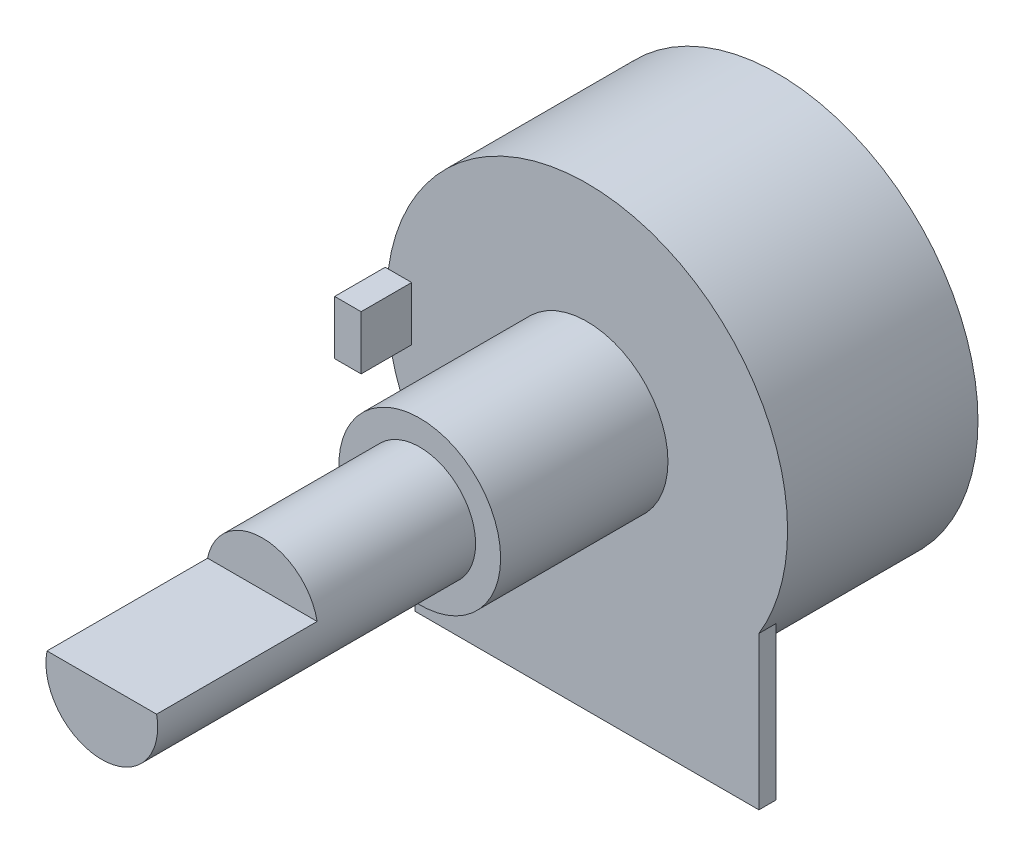
ISO-10303-21;
HEADER;
FILE_DESCRIPTION(('STEP AP214'),'2;1');
FILE_NAME('part.step','',(''),(''),'','','');
FILE_SCHEMA(('AUTOMOTIVE_DESIGN { 1 0 10303 214 1 1 1 1 }'));
ENDSEC;
DATA;
#1=APPLICATION_CONTEXT('core data for automotive mechanical design processes');
#2=APPLICATION_PROTOCOL_DEFINITION('international standard','automotive_design',2000,#1);
#3=PRODUCT_CONTEXT('',#1,'mechanical');
#4=PRODUCT('Part','Part','',(#3));
#5=PRODUCT_RELATED_PRODUCT_CATEGORY('part','',(#4));
#6=PRODUCT_DEFINITION_FORMATION('','',#4);
#7=PRODUCT_DEFINITION_CONTEXT('part definition',#1,'design');
#8=PRODUCT_DEFINITION('design','',#6,#7);
#9=PRODUCT_DEFINITION_SHAPE('','',#8);
#10=(LENGTH_UNIT() NAMED_UNIT(*) SI_UNIT(.MILLI.,.METRE.));
#11=(NAMED_UNIT(*) PLANE_ANGLE_UNIT() SI_UNIT($,.RADIAN.));
#12=(NAMED_UNIT(*) SI_UNIT($,.STERADIAN.) SOLID_ANGLE_UNIT());
#13=UNCERTAINTY_MEASURE_WITH_UNIT(LENGTH_MEASURE(1.E-05),#10,'distance_accuracy_value','');
#14=(GEOMETRIC_REPRESENTATION_CONTEXT(3) GLOBAL_UNCERTAINTY_ASSIGNED_CONTEXT((#13)) GLOBAL_UNIT_ASSIGNED_CONTEXT((#10,
#11,#12)) REPRESENTATION_CONTEXT('',''));
#15=CARTESIAN_POINT('',(0.,0.,0.));
#16=DIRECTION('',(0.,0.,1.));
#17=DIRECTION('',(1.,0.,0.));
#18=AXIS2_PLACEMENT_3D('',#15,#16,#17);
#19=CARTESIAN_POINT('',(0.,11.9,0.));
#20=DIRECTION('',(0.,0.,-1.));
#21=DIRECTION('',(-1.,0.,0.));
#22=AXIS2_PLACEMENT_3D('',#19,#20,#21);
#23=PLANE('',#22);
#24=CARTESIAN_POINT('',(0.,0.,0.));
#25=DIRECTION('',(0.,0.,1.));
#26=DIRECTION('',(1.,0.,0.));
#27=AXIS2_PLACEMENT_3D('',#24,#25,#26);
#28=CIRCLE('',#27,4.8);
#29=CARTESIAN_POINT('',(4.8,0.,0.));
#30=VERTEX_POINT('',#29);
#31=EDGE_CURVE('E199',#30,#30,#28,.T.);
#32=ORIENTED_EDGE('',*,*,#31,.F.);
#33=EDGE_LOOP('',(#32));
#34=FACE_BOUND('',#33,.T.);
#35=DIRECTION('',(1.,0.,0.));
#36=VECTOR('',#35,1.);
#37=CARTESIAN_POINT('',(0.,-1.6,0.));
#38=LINE('',#37,#36);
#39=CARTESIAN_POINT('',(-11.7919464042201,-1.6,0.));
#40=VERTEX_POINT('',#39);
#41=CARTESIAN_POINT('',(-10.41,-1.6,0.));
#42=VERTEX_POINT('',#41);
#43=EDGE_CURVE('E210',#40,#42,#38,.T.);
#44=ORIENTED_EDGE('',*,*,#43,.F.);
#45=CARTESIAN_POINT('',(0.,0.,0.));
#46=DIRECTION('',(0.,0.,1.));
#47=DIRECTION('',(1.,0.,0.));
#48=AXIS2_PLACEMENT_3D('',#45,#46,#47);
#49=CIRCLE('',#48,11.9);
#50=CARTESIAN_POINT('',(-10.2,-6.12943716828878,0.));
#51=VERTEX_POINT('',#50);
#52=EDGE_CURVE('E207',#40,#51,#49,.T.);
#53=ORIENTED_EDGE('',*,*,#52,.T.);
#54=DIRECTION('',(0.,-1.,0.));
#55=VECTOR('',#54,1.);
#56=CARTESIAN_POINT('',(-10.2,-15.2,0.));
#57=LINE('',#56,#55);
#58=CARTESIAN_POINT('',(-10.2,-15.2,0.));
#59=VERTEX_POINT('',#58);
#60=EDGE_CURVE('E128',#51,#59,#57,.T.);
#61=ORIENTED_EDGE('',*,*,#60,.T.);
#62=DIRECTION('',(1.,0.,0.));
#63=VECTOR('',#62,1.);
#64=CARTESIAN_POINT('',(-10.2,-15.2,0.));
#65=LINE('',#64,#63);
#66=CARTESIAN_POINT('',(10.2,-15.2,0.));
#67=VERTEX_POINT('',#66);
#68=EDGE_CURVE('E136',#59,#67,#65,.T.);
#69=ORIENTED_EDGE('',*,*,#68,.T.);
#70=DIRECTION('',(0.,1.,0.));
#71=VECTOR('',#70,1.);
#72=CARTESIAN_POINT('',(10.2,-15.2,0.));
#73=LINE('',#72,#71);
#74=CARTESIAN_POINT('',(10.2,-6.12943716828878,0.));
#75=VERTEX_POINT('',#74);
#76=EDGE_CURVE('E56',#67,#75,#73,.T.);
#77=ORIENTED_EDGE('',*,*,#76,.T.);
#78=CARTESIAN_POINT('',(-11.7919464042201,1.6,0.));
#79=VERTEX_POINT('',#78);
#80=EDGE_CURVE('E202',#75,#79,#49,.T.);
#81=ORIENTED_EDGE('',*,*,#80,.T.);
#82=DIRECTION('',(-1.,0.,0.));
#83=VECTOR('',#82,1.);
#84=CARTESIAN_POINT('',(-11.98,1.6,0.));
#85=LINE('',#84,#83);
#86=CARTESIAN_POINT('',(-10.41,1.6,0.));
#87=VERTEX_POINT('',#86);
#88=EDGE_CURVE('E162',#87,#79,#85,.T.);
#89=ORIENTED_EDGE('',*,*,#88,.F.);
#90=DIRECTION('',(0.,1.,0.));
#91=VECTOR('',#90,1.);
#92=CARTESIAN_POINT('',(-10.41,1.6,0.));
#93=LINE('',#92,#91);
#94=EDGE_CURVE('E174',#42,#87,#93,.T.);
#95=ORIENTED_EDGE('',*,*,#94,.F.);
#96=EDGE_LOOP('',(#44,#53,#61,#69,#77,#81,#89,#95));
#97=FACE_BOUND('',#96,.T.);
#98=ADVANCED_FACE('F33',(#34,#97),#23,.F.);
#99=CARTESIAN_POINT('',(0.,3.315,28.8));
#100=DIRECTION('',(0.,0.,-1.));
#101=DIRECTION('',(-1.,0.,0.));
#102=AXIS2_PLACEMENT_3D('',#99,#100,#101);
#103=PLANE('',#102);
#104=CARTESIAN_POINT('',(0.,0.,28.8));
#105=DIRECTION('',(0.,0.,1.));
#106=DIRECTION('',(1.,0.,0.));
#107=AXIS2_PLACEMENT_3D('',#104,#105,#106);
#108=CIRCLE('',#107,3.315);
#109=CARTESIAN_POINT('',(-3.25164573716142,0.645000000000001,28.8));
#110=VERTEX_POINT('',#109);
#111=CARTESIAN_POINT('',(3.25164573716141,0.645000000000001,28.8));
#112=VERTEX_POINT('',#111);
#113=EDGE_CURVE('E191',#110,#112,#108,.T.);
#114=ORIENTED_EDGE('',*,*,#113,.T.);
#115=DIRECTION('',(1.,0.,0.));
#116=VECTOR('',#115,1.);
#117=CARTESIAN_POINT('',(-11.98,0.645000000000001,28.8));
#118=LINE('',#117,#116);
#119=EDGE_CURVE('E125',#110,#112,#118,.T.);
#120=ORIENTED_EDGE('',*,*,#119,.F.);
#121=EDGE_LOOP('',(#114,#120));
#122=FACE_BOUND('',#121,.T.);
#123=ADVANCED_FACE('F35',(#122),#103,.F.);
#124=CARTESIAN_POINT('',(0.,0.,-11.3));
#125=DIRECTION('',(0.,0.,1.));
#126=DIRECTION('',(1.,0.,0.));
#127=AXIS2_PLACEMENT_3D('',#124,#125,#126);
#128=PLANE('',#127);
#129=CARTESIAN_POINT('',(0.,0.,-11.3));
#130=DIRECTION('',(0.,0.,1.));
#131=DIRECTION('',(1.,0.,0.));
#132=AXIS2_PLACEMENT_3D('',#129,#130,#131);
#133=CIRCLE('',#132,11.9);
#134=CARTESIAN_POINT('',(11.9,0.,-11.3));
#135=VERTEX_POINT('',#134);
#136=EDGE_CURVE('E206',#135,#135,#133,.T.);
#137=ORIENTED_EDGE('',*,*,#136,.F.);
#138=EDGE_LOOP('',(#137));
#139=FACE_BOUND('',#138,.T.);
#140=ADVANCED_FACE('F257',(#139),#128,.F.);
#141=CARTESIAN_POINT('',(0.,0.,28.8));
#142=DIRECTION('',(0.,0.,1.));
#143=DIRECTION('',(1.,0.,0.));
#144=AXIS2_PLACEMENT_3D('',#141,#142,#143);
#145=CYLINDRICAL_SURFACE('',#144,11.9);
#146=ORIENTED_EDGE('',*,*,#80,.F.);
#147=DIRECTION('',(0.,0.,1.));
#148=VECTOR('',#147,1.);
#149=CARTESIAN_POINT('',(10.2,-6.12943716828878,-1.));
#150=LINE('',#149,#148);
#151=CARTESIAN_POINT('',(10.2,-6.12943716828878,-1.));
#152=VERTEX_POINT('',#151);
#153=EDGE_CURVE('E144',#152,#75,#150,.T.);
#154=ORIENTED_EDGE('',*,*,#153,.F.);
#155=CARTESIAN_POINT('',(0.,0.,-1.));
#156=DIRECTION('',(0.,0.,-1.));
#157=DIRECTION('',(1.,0.,0.));
#158=AXIS2_PLACEMENT_3D('',#155,#156,#157);
#159=CIRCLE('',#158,11.9);
#160=CARTESIAN_POINT('',(-10.2,-6.12943716828878,-1.));
#161=VERTEX_POINT('',#160);
#162=EDGE_CURVE('E135',#152,#161,#159,.T.);
#163=ORIENTED_EDGE('',*,*,#162,.T.);
#164=DIRECTION('',(0.,0.,1.));
#165=VECTOR('',#164,1.);
#166=CARTESIAN_POINT('',(-10.2,-6.12943716828878,-1.));
#167=LINE('',#166,#165);
#168=EDGE_CURVE('E154',#161,#51,#167,.T.);
#169=ORIENTED_EDGE('',*,*,#168,.T.);
#170=ORIENTED_EDGE('',*,*,#52,.F.);
#171=EDGE_CURVE('E203',#79,#40,#49,.T.);
#172=ORIENTED_EDGE('',*,*,#171,.F.);
#173=EDGE_LOOP('',(#146,#154,#163,#169,#170,#172));
#174=FACE_BOUND('',#173,.T.);
#175=ORIENTED_EDGE('',*,*,#136,.T.);
#176=EDGE_LOOP('',(#175));
#177=FACE_BOUND('',#176,.T.);
#178=ADVANCED_FACE('F237',(#174,#177),#145,.T.);
#179=CARTESIAN_POINT('',(0.,0.,28.8));
#180=DIRECTION('',(0.,0.,1.));
#181=DIRECTION('',(1.,0.,0.));
#182=AXIS2_PLACEMENT_3D('',#179,#180,#181);
#183=CYLINDRICAL_SURFACE('',#182,4.8);
#184=CARTESIAN_POINT('',(0.,0.,9.93));
#185=DIRECTION('',(0.,0.,1.));
#186=DIRECTION('',(1.,0.,0.));
#187=AXIS2_PLACEMENT_3D('',#184,#185,#186);
#188=CIRCLE('',#187,4.8);
#189=CARTESIAN_POINT('',(4.8,0.,9.93));
#190=VERTEX_POINT('',#189);
#191=EDGE_CURVE('E196',#190,#190,#188,.T.);
#192=ORIENTED_EDGE('',*,*,#191,.F.);
#193=EDGE_LOOP('',(#192));
#194=FACE_BOUND('',#193,.T.);
#195=ORIENTED_EDGE('',*,*,#31,.T.);
#196=EDGE_LOOP('',(#195));
#197=FACE_BOUND('',#196,.T.);
#198=ADVANCED_FACE('F262',(#194,#197),#183,.T.);
#199=CARTESIAN_POINT('',(0.,4.8,9.93));
#200=DIRECTION('',(0.,0.,-1.));
#201=DIRECTION('',(-1.,0.,0.));
#202=AXIS2_PLACEMENT_3D('',#199,#200,#201);
#203=PLANE('',#202);
#204=CARTESIAN_POINT('',(0.,0.,9.93));
#205=DIRECTION('',(0.,0.,1.));
#206=DIRECTION('',(1.,0.,0.));
#207=AXIS2_PLACEMENT_3D('',#204,#205,#206);
#208=CIRCLE('',#207,3.315);
#209=CARTESIAN_POINT('',(3.315,0.,9.93));
#210=VERTEX_POINT('',#209);
#211=EDGE_CURVE('E193',#210,#210,#208,.T.);
#212=ORIENTED_EDGE('',*,*,#211,.F.);
#213=EDGE_LOOP('',(#212));
#214=FACE_BOUND('',#213,.T.);
#215=ORIENTED_EDGE('',*,*,#191,.T.);
#216=EDGE_LOOP('',(#215));
#217=FACE_BOUND('',#216,.T.);
#218=ADVANCED_FACE('F283',(#214,#217),#203,.F.);
#219=CARTESIAN_POINT('',(0.,0.,28.8));
#220=DIRECTION('',(0.,0.,1.));
#221=DIRECTION('',(1.,0.,0.));
#222=AXIS2_PLACEMENT_3D('',#219,#220,#221);
#223=CYLINDRICAL_SURFACE('',#222,3.315);
#224=CARTESIAN_POINT('',(0.,0.,19.27));
#225=DIRECTION('',(0.,0.,-1.));
#226=DIRECTION('',(-1.,0.,0.));
#227=AXIS2_PLACEMENT_3D('',#224,#225,#226);
#228=CIRCLE('',#227,3.315);
#229=CARTESIAN_POINT('',(-3.25164573716141,0.645000000000001,19.27));
#230=VERTEX_POINT('',#229);
#231=CARTESIAN_POINT('',(3.25164573716141,0.645000000000001,19.27));
#232=VERTEX_POINT('',#231);
#233=EDGE_CURVE('E41',#230,#232,#228,.T.);
#234=ORIENTED_EDGE('',*,*,#233,.T.);
#235=DIRECTION('',(0.,0.,1.));
#236=VECTOR('',#235,1.);
#237=CARTESIAN_POINT('',(3.25164573716141,0.645000000000001,28.8));
#238=LINE('',#237,#236);
#239=EDGE_CURVE('E11',#232,#112,#238,.T.);
#240=ORIENTED_EDGE('',*,*,#239,.T.);
#241=ORIENTED_EDGE('',*,*,#113,.F.);
#242=DIRECTION('',(0.,0.,1.));
#243=VECTOR('',#242,1.);
#244=CARTESIAN_POINT('',(-3.25164573716141,0.645000000000001,28.8));
#245=LINE('',#244,#243);
#246=EDGE_CURVE('E121',#110,#230,#245,.F.);
#247=ORIENTED_EDGE('',*,*,#246,.T.);
#248=EDGE_LOOP('',(#234,#240,#241,#247));
#249=FACE_BOUND('',#248,.T.);
#250=ORIENTED_EDGE('',*,*,#211,.T.);
#251=EDGE_LOOP('',(#250));
#252=FACE_BOUND('',#251,.T.);
#253=ADVANCED_FACE('F117',(#249,#252),#223,.T.);
#254=CARTESIAN_POINT('',(-11.98,1.6,3.));
#255=DIRECTION('',(1.,0.,0.));
#256=DIRECTION('',(0.,0.,-1.));
#257=AXIS2_PLACEMENT_3D('',#254,#255,#256);
#258=PLANE('',#257);
#259=DIRECTION('',(0.,-1.,0.));
#260=VECTOR('',#259,1.);
#261=CARTESIAN_POINT('',(-11.98,1.6,0.));
#262=LINE('',#261,#260);
#263=CARTESIAN_POINT('',(-11.98,1.6,0.));
#264=VERTEX_POINT('',#263);
#265=CARTESIAN_POINT('',(-11.98,-1.6,0.));
#266=VERTEX_POINT('',#265);
#267=EDGE_CURVE('E151',#264,#266,#262,.T.);
#268=ORIENTED_EDGE('',*,*,#267,.T.);
#269=DIRECTION('',(0.,0.,-1.));
#270=VECTOR('',#269,1.);
#271=CARTESIAN_POINT('',(-11.98,-1.6,3.));
#272=LINE('',#271,#270);
#273=CARTESIAN_POINT('',(-11.98,-1.6,3.));
#274=VERTEX_POINT('',#273);
#275=EDGE_CURVE('E188',#274,#266,#272,.T.);
#276=ORIENTED_EDGE('',*,*,#275,.F.);
#277=DIRECTION('',(0.,-1.,0.));
#278=VECTOR('',#277,1.);
#279=CARTESIAN_POINT('',(-11.98,1.6,3.));
#280=LINE('',#279,#278);
#281=CARTESIAN_POINT('',(-11.98,1.6,3.));
#282=VERTEX_POINT('',#281);
#283=EDGE_CURVE('E158',#282,#274,#280,.T.);
#284=ORIENTED_EDGE('',*,*,#283,.F.);
#285=DIRECTION('',(0.,0.,-1.));
#286=VECTOR('',#285,1.);
#287=CARTESIAN_POINT('',(-11.98,1.6,3.));
#288=LINE('',#287,#286);
#289=EDGE_CURVE('E168',#282,#264,#288,.T.);
#290=ORIENTED_EDGE('',*,*,#289,.T.);
#291=EDGE_LOOP('',(#268,#276,#284,#290));
#292=FACE_BOUND('',#291,.T.);
#293=ADVANCED_FACE('F230',(#292),#258,.F.);
#294=CARTESIAN_POINT('',(-11.98,-1.6,3.));
#295=DIRECTION('',(0.,1.,0.));
#296=DIRECTION('',(0.,0.,1.));
#297=AXIS2_PLACEMENT_3D('',#294,#295,#296);
#298=PLANE('',#297);
#299=DIRECTION('',(1.,0.,0.));
#300=VECTOR('',#299,1.);
#301=CARTESIAN_POINT('',(-11.98,-1.6,0.));
#302=LINE('',#301,#300);
#303=EDGE_CURVE('E171',#266,#40,#302,.T.);
#304=ORIENTED_EDGE('',*,*,#303,.T.);
#305=ORIENTED_EDGE('',*,*,#43,.T.);
#306=DIRECTION('',(0.,0.,-1.));
#307=VECTOR('',#306,1.);
#308=CARTESIAN_POINT('',(-10.41,-1.6,3.));
#309=LINE('',#308,#307);
#310=CARTESIAN_POINT('',(-10.41,-1.6,3.));
#311=VERTEX_POINT('',#310);
#312=EDGE_CURVE('E185',#311,#42,#309,.T.);
#313=ORIENTED_EDGE('',*,*,#312,.F.);
#314=DIRECTION('',(1.,0.,0.));
#315=VECTOR('',#314,1.);
#316=CARTESIAN_POINT('',(-11.98,-1.6,3.));
#317=LINE('',#316,#315);
#318=EDGE_CURVE('E161',#274,#311,#317,.T.);
#319=ORIENTED_EDGE('',*,*,#318,.F.);
#320=ORIENTED_EDGE('',*,*,#275,.T.);
#321=EDGE_LOOP('',(#304,#305,#313,#319,#320));
#322=FACE_BOUND('',#321,.T.);
#323=ADVANCED_FACE('F215',(#322),#298,.F.);
#324=CARTESIAN_POINT('',(-10.41,1.6,3.));
#325=DIRECTION('',(-1.,0.,0.));
#326=DIRECTION('',(0.,0.,1.));
#327=AXIS2_PLACEMENT_3D('',#324,#325,#326);
#328=PLANE('',#327);
#329=ORIENTED_EDGE('',*,*,#94,.T.);
#330=DIRECTION('',(0.,0.,-1.));
#331=VECTOR('',#330,1.);
#332=CARTESIAN_POINT('',(-10.41,1.6,3.));
#333=LINE('',#332,#331);
#334=CARTESIAN_POINT('',(-10.41,1.6,3.));
#335=VERTEX_POINT('',#334);
#336=EDGE_CURVE('E182',#335,#87,#333,.T.);
#337=ORIENTED_EDGE('',*,*,#336,.F.);
#338=DIRECTION('',(0.,1.,0.));
#339=VECTOR('',#338,1.);
#340=CARTESIAN_POINT('',(-10.41,1.6,3.));
#341=LINE('',#340,#339);
#342=EDGE_CURVE('E164',#311,#335,#341,.T.);
#343=ORIENTED_EDGE('',*,*,#342,.F.);
#344=ORIENTED_EDGE('',*,*,#312,.T.);
#345=EDGE_LOOP('',(#329,#337,#343,#344));
#346=FACE_BOUND('',#345,.T.);
#347=ADVANCED_FACE('F220',(#346),#328,.F.);
#348=CARTESIAN_POINT('',(-11.98,1.6,3.));
#349=DIRECTION('',(0.,-1.,0.));
#350=DIRECTION('',(0.,0.,-1.));
#351=AXIS2_PLACEMENT_3D('',#348,#349,#350);
#352=PLANE('',#351);
#353=ORIENTED_EDGE('',*,*,#88,.T.);
#354=EDGE_CURVE('E177',#79,#264,#85,.T.);
#355=ORIENTED_EDGE('',*,*,#354,.T.);
#356=ORIENTED_EDGE('',*,*,#289,.F.);
#357=DIRECTION('',(-1.,0.,0.));
#358=VECTOR('',#357,1.);
#359=CARTESIAN_POINT('',(-11.98,1.6,3.));
#360=LINE('',#359,#358);
#361=EDGE_CURVE('E166',#335,#282,#360,.T.);
#362=ORIENTED_EDGE('',*,*,#361,.F.);
#363=ORIENTED_EDGE('',*,*,#336,.T.);
#364=EDGE_LOOP('',(#353,#355,#356,#362,#363));
#365=FACE_BOUND('',#364,.T.);
#366=ADVANCED_FACE('F241',(#365),#352,.F.);
#367=CARTESIAN_POINT('',(0.,0.,3.));
#368=DIRECTION('',(0.,0.,1.));
#369=DIRECTION('',(1.,0.,0.));
#370=AXIS2_PLACEMENT_3D('',#367,#368,#369);
#371=PLANE('',#370);
#372=ORIENTED_EDGE('',*,*,#283,.T.);
#373=ORIENTED_EDGE('',*,*,#318,.T.);
#374=ORIENTED_EDGE('',*,*,#342,.T.);
#375=ORIENTED_EDGE('',*,*,#361,.T.);
#376=EDGE_LOOP('',(#372,#373,#374,#375));
#377=FACE_BOUND('',#376,.T.);
#378=ADVANCED_FACE('F224',(#377),#371,.T.);
#379=CARTESIAN_POINT('',(0.,0.,0.));
#380=DIRECTION('',(0.,0.,1.));
#381=DIRECTION('',(1.,0.,0.));
#382=AXIS2_PLACEMENT_3D('',#379,#380,#381);
#383=PLANE('',#382);
#384=ORIENTED_EDGE('',*,*,#354,.F.);
#385=ORIENTED_EDGE('',*,*,#171,.T.);
#386=ORIENTED_EDGE('',*,*,#303,.F.);
#387=ORIENTED_EDGE('',*,*,#267,.F.);
#388=EDGE_LOOP('',(#384,#385,#386,#387));
#389=FACE_BOUND('',#388,.T.);
#390=ADVANCED_FACE('F233',(#389),#383,.F.);
#391=CARTESIAN_POINT('',(10.2,-15.2,-1.));
#392=DIRECTION('',(1.,0.,0.));
#393=DIRECTION('',(0.,0.,-1.));
#394=AXIS2_PLACEMENT_3D('',#391,#392,#393);
#395=PLANE('',#394);
#396=ORIENTED_EDGE('',*,*,#76,.F.);
#397=DIRECTION('',(0.,0.,1.));
#398=VECTOR('',#397,1.);
#399=CARTESIAN_POINT('',(10.2,-15.2,-1.));
#400=LINE('',#399,#398);
#401=CARTESIAN_POINT('',(10.2,-15.2,-1.));
#402=VERTEX_POINT('',#401);
#403=EDGE_CURVE('E149',#402,#67,#400,.T.);
#404=ORIENTED_EDGE('',*,*,#403,.F.);
#405=DIRECTION('',(0.,1.,0.));
#406=VECTOR('',#405,1.);
#407=CARTESIAN_POINT('',(10.2,-15.2,-1.));
#408=LINE('',#407,#406);
#409=EDGE_CURVE('E132',#402,#152,#408,.T.);
#410=ORIENTED_EDGE('',*,*,#409,.T.);
#411=ORIENTED_EDGE('',*,*,#153,.T.);
#412=EDGE_LOOP('',(#396,#404,#410,#411));
#413=FACE_BOUND('',#412,.T.);
#414=ADVANCED_FACE('F331',(#413),#395,.T.);
#415=CARTESIAN_POINT('',(-10.2,-15.2,-1.));
#416=DIRECTION('',(0.,-1.,0.));
#417=DIRECTION('',(1.,0.,0.));
#418=AXIS2_PLACEMENT_3D('',#415,#416,#417);
#419=PLANE('',#418);
#420=ORIENTED_EDGE('',*,*,#68,.F.);
#421=DIRECTION('',(0.,0.,1.));
#422=VECTOR('',#421,1.);
#423=CARTESIAN_POINT('',(-10.2,-15.2,-1.));
#424=LINE('',#423,#422);
#425=CARTESIAN_POINT('',(-10.2,-15.2,-1.));
#426=VERTEX_POINT('',#425);
#427=EDGE_CURVE('E152',#426,#59,#424,.T.);
#428=ORIENTED_EDGE('',*,*,#427,.F.);
#429=DIRECTION('',(1.,0.,0.));
#430=VECTOR('',#429,1.);
#431=CARTESIAN_POINT('',(-10.2,-15.2,-1.));
#432=LINE('',#431,#430);
#433=EDGE_CURVE('E142',#426,#402,#432,.T.);
#434=ORIENTED_EDGE('',*,*,#433,.T.);
#435=ORIENTED_EDGE('',*,*,#403,.T.);
#436=EDGE_LOOP('',(#420,#428,#434,#435));
#437=FACE_BOUND('',#436,.T.);
#438=ADVANCED_FACE('F347',(#437),#419,.T.);
#439=CARTESIAN_POINT('',(-10.2,-15.2,-1.));
#440=DIRECTION('',(-1.,0.,0.));
#441=DIRECTION('',(0.,0.,1.));
#442=AXIS2_PLACEMENT_3D('',#439,#440,#441);
#443=PLANE('',#442);
#444=ORIENTED_EDGE('',*,*,#60,.F.);
#445=ORIENTED_EDGE('',*,*,#168,.F.);
#446=DIRECTION('',(0.,-1.,0.));
#447=VECTOR('',#446,1.);
#448=CARTESIAN_POINT('',(-10.2,-15.2,-1.));
#449=LINE('',#448,#447);
#450=EDGE_CURVE('E139',#161,#426,#449,.T.);
#451=ORIENTED_EDGE('',*,*,#450,.T.);
#452=ORIENTED_EDGE('',*,*,#427,.T.);
#453=EDGE_LOOP('',(#444,#445,#451,#452));
#454=FACE_BOUND('',#453,.T.);
#455=ADVANCED_FACE('F356',(#454),#443,.T.);
#456=CARTESIAN_POINT('',(0.,0.,-1.));
#457=DIRECTION('',(0.,0.,1.));
#458=DIRECTION('',(1.,0.,0.));
#459=AXIS2_PLACEMENT_3D('',#456,#457,#458);
#460=PLANE('',#459);
#461=ORIENTED_EDGE('',*,*,#409,.F.);
#462=ORIENTED_EDGE('',*,*,#433,.F.);
#463=ORIENTED_EDGE('',*,*,#450,.F.);
#464=ORIENTED_EDGE('',*,*,#162,.F.);
#465=EDGE_LOOP('',(#461,#462,#463,#464));
#466=FACE_BOUND('',#465,.T.);
#467=ADVANCED_FACE('F365',(#466),#460,.F.);
#468=CARTESIAN_POINT('',(-11.98,3.315,19.27));
#469=DIRECTION('',(0.,0.,-1.));
#470=DIRECTION('',(-1.,0.,0.));
#471=AXIS2_PLACEMENT_3D('',#468,#469,#470);
#472=PLANE('',#471);
#473=DIRECTION('',(1.,0.,0.));
#474=VECTOR('',#473,1.);
#475=CARTESIAN_POINT('',(-11.98,0.645000000000001,19.27));
#476=LINE('',#475,#474);
#477=EDGE_CURVE('E48',#230,#232,#476,.T.);
#478=ORIENTED_EDGE('',*,*,#477,.T.);
#479=ORIENTED_EDGE('',*,*,#233,.F.);
#480=EDGE_LOOP('',(#478,#479));
#481=FACE_BOUND('',#480,.T.);
#482=ADVANCED_FACE('F126',(#481),#472,.F.);
#483=CARTESIAN_POINT('',(-11.98,0.645000000000001,28.8));
#484=DIRECTION('',(0.,-1.,0.));
#485=DIRECTION('',(0.,0.,-1.));
#486=AXIS2_PLACEMENT_3D('',#483,#484,#485);
#487=PLANE('',#486);
#488=ORIENTED_EDGE('',*,*,#477,.F.);
#489=ORIENTED_EDGE('',*,*,#246,.F.);
#490=ORIENTED_EDGE('',*,*,#119,.T.);
#491=ORIENTED_EDGE('',*,*,#239,.F.);
#492=EDGE_LOOP('',(#488,#489,#490,#491));
#493=FACE_BOUND('',#492,.T.);
#494=ADVANCED_FACE('F123',(#493),#487,.F.);
#495=CLOSED_SHELL('',(#98,#123,#140,#178,#198,#218,#253,#293,#323,#347,#366,#378,#390,#414,#438,
#455,#467,#482,#494));
#496=MANIFOLD_SOLID_BREP('B2',#495);
#497=ADVANCED_BREP_SHAPE_REPRESENTATION('',(#18,#496),#14);
#498=SHAPE_DEFINITION_REPRESENTATION(#9,#497);
ENDSEC;
END-ISO-10303-21;
